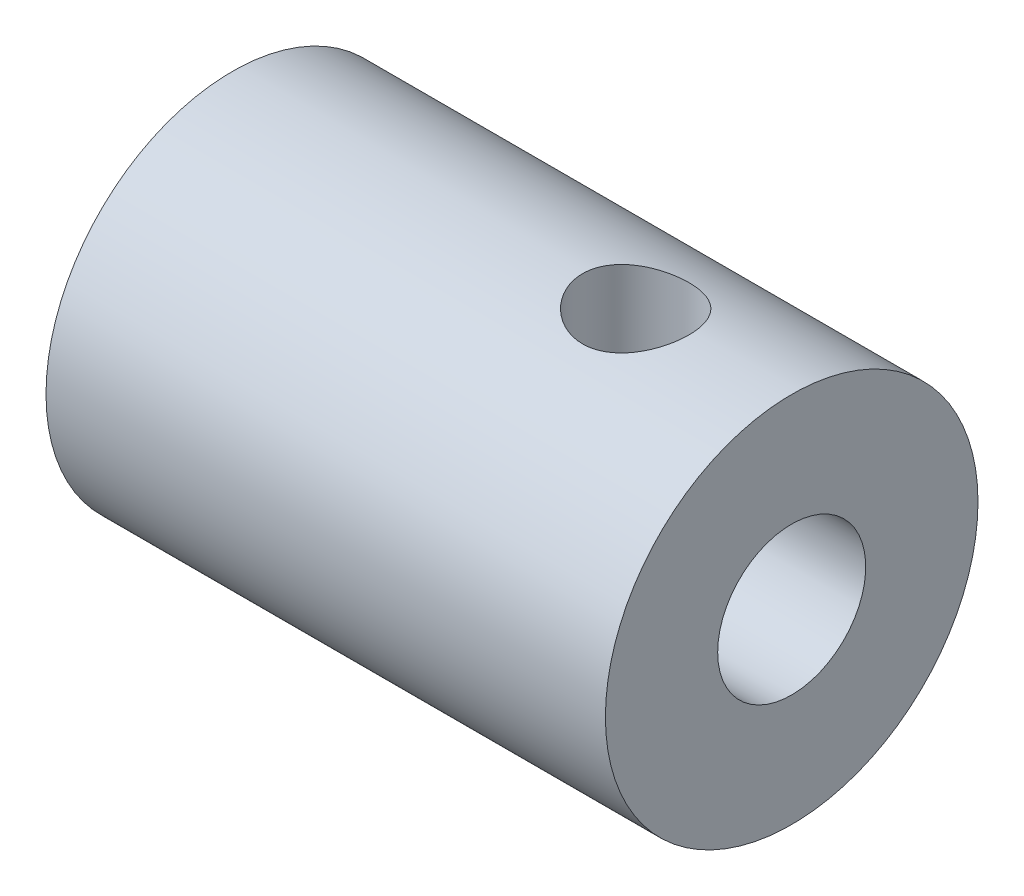
ISO-10303-21;
HEADER;
FILE_DESCRIPTION(('STEP AP214'),'2;1');
FILE_NAME('part.step','',(''),(''),'','','');
FILE_SCHEMA(('AUTOMOTIVE_DESIGN { 1 0 10303 214 1 1 1 1 }'));
ENDSEC;
DATA;
#1=APPLICATION_CONTEXT('core data for automotive mechanical design processes');
#2=APPLICATION_PROTOCOL_DEFINITION('international standard','automotive_design',2000,#1);
#3=PRODUCT_CONTEXT('',#1,'mechanical');
#4=PRODUCT('Part','Part','',(#3));
#5=PRODUCT_RELATED_PRODUCT_CATEGORY('part','',(#4));
#6=PRODUCT_DEFINITION_FORMATION('','',#4);
#7=PRODUCT_DEFINITION_CONTEXT('part definition',#1,'design');
#8=PRODUCT_DEFINITION('design','',#6,#7);
#9=PRODUCT_DEFINITION_SHAPE('','',#8);
#10=(LENGTH_UNIT() NAMED_UNIT(*) SI_UNIT(.MILLI.,.METRE.));
#11=(NAMED_UNIT(*) PLANE_ANGLE_UNIT() SI_UNIT($,.RADIAN.));
#12=(NAMED_UNIT(*) SI_UNIT($,.STERADIAN.) SOLID_ANGLE_UNIT());
#13=UNCERTAINTY_MEASURE_WITH_UNIT(LENGTH_MEASURE(1.E-05),#10,'distance_accuracy_value','');
#14=(GEOMETRIC_REPRESENTATION_CONTEXT(3) GLOBAL_UNCERTAINTY_ASSIGNED_CONTEXT((#13)) GLOBAL_UNIT_ASSIGNED_CONTEXT((#10,
#11,#12)) REPRESENTATION_CONTEXT('',''));
#15=CARTESIAN_POINT('',(0.,0.,0.));
#16=DIRECTION('',(0.,0.,1.));
#17=DIRECTION('',(1.,0.,0.));
#18=AXIS2_PLACEMENT_3D('',#15,#16,#17);
#19=CARTESIAN_POINT('',(0.,0.,0.));
#20=DIRECTION('',(-1.,0.,0.));
#21=DIRECTION('',(0.,0.,1.));
#22=AXIS2_PLACEMENT_3D('',#19,#20,#21);
#23=CYLINDRICAL_SURFACE('',#22,4.7625);
#24=CARTESIAN_POINT('',(2.6035,-4.7625,0.));
#25=CARTESIAN_POINT('',(2.60350132802397,-4.76249910615411,0.0747130529778893));
#26=CARTESIAN_POINT('',(2.60968218956907,-4.76072484176044,0.149439770560647));
#27=CARTESIAN_POINT('',(2.63419045488752,-4.75381979521838,0.29672763904972));
#28=CARTESIAN_POINT('',(2.65252248077178,-4.74868773582743,0.369287954910806));
#29=CARTESIAN_POINT('',(2.70067887838141,-4.73563130773512,0.510096647559027));
#30=CARTESIAN_POINT('',(2.73048725167652,-4.72771082749983,0.578350873706299));
#31=CARTESIAN_POINT('',(2.80068740651401,-4.70990700954045,0.708892135043703));
#32=CARTESIAN_POINT('',(2.84108028731264,-4.70002346796803,0.771178549527407));
#33=CARTESIAN_POINT('',(2.93242020746837,-4.67906373955543,0.889649651730132));
#34=CARTESIAN_POINT('',(2.98359386370883,-4.66796490800477,0.945655610055492));
#35=CARTESIAN_POINT('',(3.09455908825951,-4.64596516914378,1.0484184909622));
#36=CARTESIAN_POINT('',(3.15435194250602,-4.63506429164082,1.09517403095885));
#37=CARTESIAN_POINT('',(3.28233155601516,-4.61445881113562,1.17901776862754));
#38=CARTESIAN_POINT('',(3.35066248018866,-4.60478254947106,1.21589352500811));
#39=CARTESIAN_POINT('',(3.4928758525282,-4.5880578689383,1.27755991315349));
#40=CARTESIAN_POINT('',(3.56675710606092,-4.58100888651982,1.30235313696768));
#41=CARTESIAN_POINT('',(3.71597894243543,-4.57057187087897,1.33851692730094));
#42=CARTESIAN_POINT('',(3.7912338681259,-4.56709481286359,1.35021458589323));
#43=CARTESIAN_POINT('',(3.94271218430989,-4.56392995914291,1.36087589799455));
#44=CARTESIAN_POINT('',(4.01893536141339,-4.56424134250628,1.35984231028366));
#45=CARTESIAN_POINT('',(4.16757606825807,-4.56853893279477,1.34532862879658));
#46=CARTESIAN_POINT('',(4.24003697981751,-4.57240605959699,1.33225183347416));
#47=CARTESIAN_POINT('',(4.38169070569852,-4.58318766064072,1.29467196470204));
#48=CARTESIAN_POINT('',(4.4508832246597,-4.59010240971079,1.27016786074857));
#49=CARTESIAN_POINT('',(4.58505171619238,-4.60629950381668,1.21011778079942));
#50=CARTESIAN_POINT('',(4.64996339303076,-4.6156106498115,1.17443624887876));
#51=CARTESIAN_POINT('',(4.77301598810202,-4.63553682583539,1.09313853115981));
#52=CARTESIAN_POINT('',(4.8311553981387,-4.64615214522885,1.04752013887182));
#53=CARTESIAN_POINT('',(4.94130838962143,-4.66797933994029,0.945613808374621));
#54=CARTESIAN_POINT('',(4.99300964120024,-4.67919864201871,0.888989324200014));
#55=CARTESIAN_POINT('',(5.08625127397521,-4.70061425563701,0.767734854711598));
#56=CARTESIAN_POINT('',(5.12779113137947,-4.71081051442586,0.703104456973554));
#57=CARTESIAN_POINT('',(5.19969641337201,-4.7291097983759,0.567143378034054));
#58=CARTESIAN_POINT('',(5.22999836281593,-4.7372008583588,0.49577740978272));
#59=CARTESIAN_POINT('',(5.27808059584143,-4.75029187375806,0.348679021038379));
#60=CARTESIAN_POINT('',(5.29586402685173,-4.75529260611158,0.27294770327371));
#61=CARTESIAN_POINT('',(5.3178979067378,-4.7615190609649,0.121928159085001));
#62=CARTESIAN_POINT('',(5.32257223625847,-4.76286298156601,0.0467065564677234));
#63=CARTESIAN_POINT('',(5.31943537678374,-4.76196800761694,-0.103448322015913));
#64=CARTESIAN_POINT('',(5.31162568158639,-4.7597295417235,-0.178381631303094));
#65=CARTESIAN_POINT('',(5.28408763245719,-4.75199826556876,-0.324272411558481));
#66=CARTESIAN_POINT('',(5.26460186136451,-4.74657173442845,-0.395279512238859));
#67=CARTESIAN_POINT('',(5.21455202783244,-4.73308606280185,-0.533005492039659));
#68=CARTESIAN_POINT('',(5.18398668569606,-4.72502661822315,-0.599723874762199));
#69=CARTESIAN_POINT('',(5.11190029589263,-4.70690007925331,-0.728578003267581));
#70=CARTESIAN_POINT('',(5.0701567937936,-4.69679336748189,-0.7905835803644));
#71=CARTESIAN_POINT('',(4.97717344661831,-4.67573685565677,-0.906856321261833));
#72=CARTESIAN_POINT('',(4.92593144711736,-4.66478686466267,-0.961121724505211));
#73=CARTESIAN_POINT('',(4.81341888361094,-4.64283250450958,-1.06220467816609));
#74=CARTESIAN_POINT('',(4.75187574438686,-4.63183800989465,-1.10872158995048));
#75=CARTESIAN_POINT('',(4.62161997761782,-4.61142480451941,-1.19078217067452));
#76=CARTESIAN_POINT('',(4.55290760095905,-4.60200603864676,-1.22632622343521));
#77=CARTESIAN_POINT('',(4.41055032317316,-4.58592072488041,-1.28517268145781));
#78=CARTESIAN_POINT('',(4.33693404792279,-4.5792395959238,-1.30854012713244));
#79=CARTESIAN_POINT('',(4.18658933686106,-4.56940281032297,-1.34249121008744));
#80=CARTESIAN_POINT('',(4.10986184816905,-4.56624608900114,-1.35307870810188));
#81=CARTESIAN_POINT('',(3.95857471753248,-4.56391335454088,-1.36092455040578));
#82=CARTESIAN_POINT('',(3.88404221292628,-4.56459194886419,-1.35866970788407));
#83=CARTESIAN_POINT('',(3.73646709551818,-4.5695079526439,-1.3420420529431));
#84=CARTESIAN_POINT('',(3.66342443333104,-4.5737452439397,-1.32766964286741));
#85=CARTESIAN_POINT('',(3.52161489027463,-4.58520849858503,-1.28751515000952));
#86=CARTESIAN_POINT('',(3.45281215061304,-4.59240370727278,-1.26185029178566));
#87=CARTESIAN_POINT('',(3.32043494641326,-4.60896913868397,-1.19993011119005));
#88=CARTESIAN_POINT('',(3.25686140766293,-4.61833974542644,-1.16367291868063));
#89=CARTESIAN_POINT('',(3.1344585736249,-4.63858981495493,-1.0801812993991));
#90=CARTESIAN_POINT('',(3.07585780150345,-4.64950913599081,-1.03262149419702));
#91=CARTESIAN_POINT('',(2.96731095484128,-4.67142023258267,-0.928475317194594));
#92=CARTESIAN_POINT('',(2.91736706152056,-4.6824120256769,-0.871886677332632));
#93=CARTESIAN_POINT('',(2.82628658327082,-4.70356613921108,-0.749545117737117));
#94=CARTESIAN_POINT('',(2.78540778319881,-4.71370007221687,-0.683594906488905));
#95=CARTESIAN_POINT('',(2.71537924841101,-4.73167059506192,-0.545468955126885));
#96=CARTESIAN_POINT('',(2.68622308081922,-4.73950844425046,-0.473296655907664));
#97=CARTESIAN_POINT('',(2.64362765596444,-4.75116806432972,-0.334651372172605));
#98=CARTESIAN_POINT('',(2.62861783065919,-4.75538435031651,-0.268690220034189));
#99=CARTESIAN_POINT('',(2.6085540640398,-4.76105053847871,-0.135156295305951));
#100=CARTESIAN_POINT('',(2.60349879869955,-4.76250080855278,-0.0675837382544699));
#101=CARTESIAN_POINT('',(2.6035,-4.7625,0.));
#102=B_SPLINE_CURVE_WITH_KNOTS('',3,(#24,#25,#26,#27,#28,#29,#30,#31,#32,#33,#34,#35,#36,#37,
#38,#39,#40,#41,#42,#43,#44,#45,#46,#47,#48,#49,#50,#51,#52,#53,#54,#55,#56,#57,#58,#59,#60,#61,
#62,#63,#64,#65,#66,#67,#68,#69,#70,#71,#72,#73,#74,#75,#76,#77,#78,#79,#80,#81,#82,#83,#84,#85,
#86,#87,#88,#89,#90,#91,#92,#93,#94,#95,#96,#97,#98,#99,#100,#101),.UNSPECIFIED.,.T.,.F.,(4,2,2,
2,2,2,2,2,2,2,2,2,2,2,2,2,2,2,2,2,2,2,2,2,2,2,2,2,2,2,2,2,2,2,2,2,2,2,4),(0.,0.223891093401415,
0.447867400348589,0.671532600450734,0.895221038562009,1.1241894540172,1.3531920657071,
1.58678251369104,1.82032282774805,2.04788987982158,2.27540762043045,2.49557293839875,
2.71575811450561,2.93872435402094,3.16174015397321,3.39313717400732,3.62454611940855,
3.85724291462337,4.08988118386984,4.3149052647879,4.53990242206693,4.76037966366481,
4.98088237863229,5.20614959447117,5.43146796749921,5.66413515523558,5.89679420355434,
6.12819744276731,6.35953075914808,6.58215477179628,6.80477139287779,7.02512967857782,
7.24552689333998,7.47326441045603,7.70105922603059,7.9346772997902,8.16816699845996,
8.37072076163971,8.57324758193209),.UNSPECIFIED.);
#103=CARTESIAN_POINT('',(2.6035,-4.7625,0.));
#104=VERTEX_POINT('',#103);
#105=EDGE_CURVE('E87',#104,#104,#102,.T.);
#106=ORIENTED_EDGE('',*,*,#105,.T.);
#107=EDGE_LOOP('',(#106));
#108=FACE_BOUND('',#107,.T.);
#109=CARTESIAN_POINT('',(3.9624,4.56451498409196,1.3589));
#110=CARTESIAN_POINT('',(3.88775680747235,4.56451603505844,1.35889864477218));
#111=CARTESIAN_POINT('',(3.81309990567277,4.56636596722264,1.35272893233677));
#112=CARTESIAN_POINT('',(3.66595673304113,4.57353968308075,1.3282689601314));
#113=CARTESIAN_POINT('',(3.59347136194685,4.5788648864319,1.30997374701561));
#114=CARTESIAN_POINT('',(3.452821810095,4.59233800161285,1.26192489086453));
#115=CARTESIAN_POINT('',(3.38465113957464,4.60048154896756,1.23218895697125));
#116=CARTESIAN_POINT('',(3.25425195102654,4.61866803332666,1.16215980187808));
#117=CARTESIAN_POINT('',(3.19202413478764,4.62871119423916,1.12186533592437));
#118=CARTESIAN_POINT('',(3.07349571314445,4.64988763844925,1.03062853222179));
#119=CARTESIAN_POINT('',(3.01739041925885,4.66104242220874,0.979437394274301));
#120=CARTESIAN_POINT('',(2.91443332072471,4.68300073545277,0.8683944344393));
#121=CARTESIAN_POINT('',(2.86758259694599,4.69380422378549,0.808541602338514));
#122=CARTESIAN_POINT('',(2.78363176417749,4.71408497007954,0.680500735399147));
#123=CARTESIAN_POINT('',(2.746728546074,4.72353392466409,0.61217873366752));
#124=CARTESIAN_POINT('',(2.68500902077521,4.73979257604336,0.46998416794496));
#125=CARTESIAN_POINT('',(2.66019036689376,4.74660278520021,0.396112684819376));
#126=CARTESIAN_POINT('',(2.62398436430554,4.75666453906143,0.246957397350113));
#127=CARTESIAN_POINT('',(2.61226414341945,4.76000412033045,0.171760439109778));
#128=CARTESIAN_POINT('',(2.60153754594822,4.76305736225192,0.0203983510758831));
#129=CARTESIAN_POINT('',(2.60252874531937,4.76277171422883,-0.0557665913574317));
#130=CARTESIAN_POINT('',(2.61696842879738,4.75866994750923,-0.204575702031833));
#131=CARTESIAN_POINT('',(2.63005683283178,4.75495588164616,-0.277258060412385));
#132=CARTESIAN_POINT('',(2.66773414429947,4.74453697676865,-0.419348309010543));
#133=CARTESIAN_POINT('',(2.69232375067335,4.73783195599178,-0.4887559999408));
#134=CARTESIAN_POINT('',(2.75256364787437,4.7220387960207,-0.623211172663096));
#135=CARTESIAN_POINT('',(2.78833173211534,4.71292544484585,-0.688202796200048));
#136=CARTESIAN_POINT('',(2.86982141207442,4.69328931620833,-0.811380103200588));
#137=CARTESIAN_POINT('',(2.91554518412592,4.68276623076873,-0.869564294263584));
#138=CARTESIAN_POINT('',(3.01753618646918,4.66100863096647,-0.979624807858082));
#139=CARTESIAN_POINT('',(3.0741164574673,4.6497621074787,-1.03120903512073));
#140=CARTESIAN_POINT('',(3.19523781528815,4.6281519208778,-1.12423437267076));
#141=CARTESIAN_POINT('',(3.25977954383414,4.61778832904625,-1.16567466451448));
#142=CARTESIAN_POINT('',(3.39569862353088,4.59906394952383,-1.23750224576729));
#143=CARTESIAN_POINT('',(3.46712620240598,4.59071972559669,-1.2677991178051));
#144=CARTESIAN_POINT('',(3.61436077898793,4.57717888973541,-1.3158533346299));
#145=CARTESIAN_POINT('',(3.690166499486,4.57198136486361,-1.33361431664655));
#146=CARTESIAN_POINT('',(3.841247102289,4.56552016513002,-1.35556601937419));
#147=CARTESIAN_POINT('',(3.91645261995628,4.56412891686529,-1.36019701320162));
#148=CARTESIAN_POINT('',(4.06656580839842,4.56508668911583,-1.35697936218475));
#149=CARTESIAN_POINT('',(4.14147351504998,4.56743524451886,-1.34913226921643));
#150=CARTESIAN_POINT('',(4.2870928478525,4.57548366916004,-1.32157158878809));
#151=CARTESIAN_POINT('',(4.35786121944589,4.58110584172206,-1.30213286938459));
#152=CARTESIAN_POINT('',(4.49513020897776,4.59498959657531,-1.25225502456966));
#153=CARTESIAN_POINT('',(4.56163021063817,4.60325155898123,-1.22181431485138));
#154=CARTESIAN_POINT('',(4.69028873180816,4.62173788057312,-1.1499351246311));
#155=CARTESIAN_POINT('',(4.7522995442902,4.63200565032771,-1.10824369348473));
#156=CARTESIAN_POINT('',(4.8686062233809,4.65324948525838,-1.01535279969331));
#157=CARTESIAN_POINT('',(4.92290041801461,4.66422570318845,-0.964151282005915));
#158=CARTESIAN_POINT('',(5.02411361537,4.68609700628366,-0.851638739480496));
#159=CARTESIAN_POINT('',(5.0707227488091,4.6969769166886,-0.790045376166007));
#160=CARTESIAN_POINT('',(5.15294595997986,4.71705439310083,-0.65965786929976));
#161=CARTESIAN_POINT('',(5.18856061289626,4.7262520471064,-0.590864102694882));
#162=CARTESIAN_POINT('',(5.24744410028156,4.7418701151326,-0.44850498948744));
#163=CARTESIAN_POINT('',(5.27080637043856,4.74831147680547,-0.374980702439351));
#164=CARTESIAN_POINT('',(5.30477794345696,4.75778370690101,-0.224835405201785));
#165=CARTESIAN_POINT('',(5.31539051747125,4.76081545010694,-0.148215194541387));
#166=CARTESIAN_POINT('',(5.32333224993471,4.76307896423585,0.00306974476281752));
#167=CARTESIAN_POINT('',(5.32111299188128,4.76243992427809,0.0777091466746419));
#168=CARTESIAN_POINT('',(5.3045195284057,4.75773257745494,0.225507834068754));
#169=CARTESIAN_POINT('',(5.29014590235253,4.75366443404656,0.298667189931017));
#170=CARTESIAN_POINT('',(5.24992097554746,4.74258792732383,0.44080315972444));
#171=CARTESIAN_POINT('',(5.22417290505636,4.73560603890715,0.509811190477982));
#172=CARTESIAN_POINT('',(5.16202181096896,4.71942712391017,0.642565871342411));
#173=CARTESIAN_POINT('',(5.12561714069588,4.71022975502881,0.706311706376398));
#174=CARTESIAN_POINT('',(5.04193028981196,4.69025443463538,0.828786176541995));
#175=CARTESIAN_POINT('',(4.99435736617556,4.67943767727524,0.887309780155601));
#176=CARTESIAN_POINT('',(4.89022048918341,4.65758097992779,0.995695158400413));
#177=CARTESIAN_POINT('',(4.8336540543266,4.6465409790788,1.04555453441665));
#178=CARTESIAN_POINT('',(4.71135654230063,4.6251507988277,1.13649915276305));
#179=CARTESIAN_POINT('',(4.64542432333091,4.6148262419371,1.17732054867892));
#180=CARTESIAN_POINT('',(4.50734679096369,4.59642238253575,1.24724617335738));
#181=CARTESIAN_POINT('',(4.4352049951183,4.58834181968777,1.27635698349835));
#182=CARTESIAN_POINT('',(4.29666571352837,4.57628886550273,1.31886549351769));
#183=CARTESIAN_POINT('',(4.23078347964178,4.57191256961725,1.33383994666801));
#184=CARTESIAN_POINT('',(4.09740439843775,4.56602537831392,1.35385703407256));
#185=CARTESIAN_POINT('',(4.02990780597892,4.56451403359079,1.35890122567717));
#186=CARTESIAN_POINT('',(3.9624,4.56451498409196,1.3589));
#187=B_SPLINE_CURVE_WITH_KNOTS('',3,(#109,#110,#111,#112,#113,#114,#115,#116,#117,#118,#119,
#120,#121,#122,#123,#124,#125,#126,#127,#128,#129,#130,#131,#132,#133,#134,#135,#136,#137,#138,
#139,#140,#141,#142,#143,#144,#145,#146,#147,#148,#149,#150,#151,#152,#153,#154,#155,#156,#157,
#158,#159,#160,#161,#162,#163,#164,#165,#166,#167,#168,#169,#170,#171,#172,#173,#174,#175,#176,
#177,#178,#179,#180,#181,#182,#183,#184,#185,#186),.UNSPECIFIED.,.T.,.F.,(4,2,2,2,2,2,2,2,2,2,2,
2,2,2,2,2,2,2,2,2,2,2,2,2,2,2,2,2,2,2,2,2,2,2,2,2,2,2,4),(0.,0.223680920434435,
0.447453272345167,0.670880630615005,0.894334340775211,1.12357681371209,1.3528460447753,
1.58636613521695,1.8198408605862,2.04723686453817,2.27458950514853,2.495385521695,
2.71619495799944,2.93941443657241,3.16268276045118,3.39376642707039,3.62486873208408,
3.85780685740799,4.09067736901402,4.3156412845543,4.54057722394729,4.76038034122677,
4.98021512317868,5.20547698273278,5.4307875760569,5.66368427352624,5.89656878475934,
6.12765052026222,6.35867295511819,6.58161578787048,6.80454799408254,7.02549723564213,
7.24648063671068,7.47402200068518,7.70162625746982,7.93518852109772,8.16861933815232,
8.37094960261782,8.57324813335495),.UNSPECIFIED.);
#188=CARTESIAN_POINT('',(3.9624,4.56451498409196,1.3589));
#189=VERTEX_POINT('',#188);
#190=EDGE_CURVE('E81',#189,#189,#187,.T.);
#191=ORIENTED_EDGE('',*,*,#190,.T.);
#192=EDGE_LOOP('',(#191));
#193=FACE_BOUND('',#192,.T.);
#194=CARTESIAN_POINT('',(-6.35,0.,0.));
#195=DIRECTION('',(-1.,0.,0.));
#196=DIRECTION('',(0.,0.,1.));
#197=AXIS2_PLACEMENT_3D('',#194,#195,#196);
#198=CIRCLE('',#197,4.7625);
#199=CARTESIAN_POINT('',(-6.35,0.,4.7625));
#200=VERTEX_POINT('',#199);
#201=EDGE_CURVE('E10',#200,#200,#198,.T.);
#202=ORIENTED_EDGE('',*,*,#201,.F.);
#203=EDGE_LOOP('',(#202));
#204=FACE_BOUND('',#203,.T.);
#205=CARTESIAN_POINT('',(7.9502,0.,0.));
#206=DIRECTION('',(-1.,0.,0.));
#207=DIRECTION('',(0.,0.,1.));
#208=AXIS2_PLACEMENT_3D('',#205,#206,#207);
#209=CIRCLE('',#208,4.7625);
#210=CARTESIAN_POINT('',(7.9502,0.,4.7625));
#211=VERTEX_POINT('',#210);
#212=EDGE_CURVE('E94',#211,#211,#209,.T.);
#213=ORIENTED_EDGE('',*,*,#212,.T.);
#214=EDGE_LOOP('',(#213));
#215=FACE_BOUND('',#214,.T.);
#216=ADVANCED_FACE('F37',(#108,#193,#204,#215),#23,.T.);
#217=CARTESIAN_POINT('',(-6.35,4.7625,0.));
#218=DIRECTION('',(1.,0.,0.));
#219=DIRECTION('',(0.,0.,-1.));
#220=AXIS2_PLACEMENT_3D('',#217,#218,#219);
#221=PLANE('',#220);
#222=CARTESIAN_POINT('',(-6.35,0.,0.));
#223=DIRECTION('',(-1.,0.,0.));
#224=DIRECTION('',(0.,0.,1.));
#225=AXIS2_PLACEMENT_3D('',#222,#223,#224);
#226=CIRCLE('',#225,3.175);
#227=CARTESIAN_POINT('',(-6.35,0.,3.175));
#228=VERTEX_POINT('',#227);
#229=EDGE_CURVE('E51',#228,#228,#226,.T.);
#230=ORIENTED_EDGE('',*,*,#229,.F.);
#231=EDGE_LOOP('',(#230));
#232=FACE_BOUND('',#231,.T.);
#233=ORIENTED_EDGE('',*,*,#201,.T.);
#234=EDGE_LOOP('',(#233));
#235=FACE_BOUND('',#234,.T.);
#236=ADVANCED_FACE('F114',(#232,#235),#221,.F.);
#237=CARTESIAN_POINT('',(0.,0.,0.));
#238=DIRECTION('',(-1.,0.,0.));
#239=DIRECTION('',(0.,0.,1.));
#240=AXIS2_PLACEMENT_3D('',#237,#238,#239);
#241=CYLINDRICAL_SURFACE('',#240,3.175);
#242=CARTESIAN_POINT('',(0.,0.,0.));
#243=DIRECTION('',(-1.,0.,0.));
#244=DIRECTION('',(0.,0.,1.));
#245=AXIS2_PLACEMENT_3D('',#242,#243,#244);
#246=CIRCLE('',#245,3.175);
#247=CARTESIAN_POINT('',(0.,0.,3.175));
#248=VERTEX_POINT('',#247);
#249=EDGE_CURVE('E57',#248,#248,#246,.T.);
#250=ORIENTED_EDGE('',*,*,#249,.F.);
#251=EDGE_LOOP('',(#250));
#252=FACE_BOUND('',#251,.T.);
#253=ORIENTED_EDGE('',*,*,#229,.T.);
#254=EDGE_LOOP('',(#253));
#255=FACE_BOUND('',#254,.T.);
#256=ADVANCED_FACE('F111',(#252,#255),#241,.F.);
#257=CARTESIAN_POINT('',(0.,3.175,0.));
#258=DIRECTION('',(1.,0.,0.));
#259=DIRECTION('',(0.,0.,-1.));
#260=AXIS2_PLACEMENT_3D('',#257,#258,#259);
#261=PLANE('',#260);
#262=CARTESIAN_POINT('',(0.,0.,0.));
#263=DIRECTION('',(-1.,0.,0.));
#264=DIRECTION('',(0.,0.,1.));
#265=AXIS2_PLACEMENT_3D('',#262,#263,#264);
#266=CIRCLE('',#265,1.8923);
#267=CARTESIAN_POINT('',(0.,0.,1.8923));
#268=VERTEX_POINT('',#267);
#269=EDGE_CURVE('E102',#268,#268,#266,.T.);
#270=ORIENTED_EDGE('',*,*,#269,.F.);
#271=EDGE_LOOP('',(#270));
#272=FACE_BOUND('',#271,.T.);
#273=ORIENTED_EDGE('',*,*,#249,.T.);
#274=EDGE_LOOP('',(#273));
#275=FACE_BOUND('',#274,.T.);
#276=ADVANCED_FACE('F109',(#272,#275),#261,.F.);
#277=CARTESIAN_POINT('',(0.,0.,0.));
#278=DIRECTION('',(-1.,0.,0.));
#279=DIRECTION('',(0.,0.,1.));
#280=AXIS2_PLACEMENT_3D('',#277,#278,#279);
#281=CYLINDRICAL_SURFACE('',#280,1.8923);
#282=CARTESIAN_POINT('',(3.9624,-1.31688650991648,1.3589));
#283=CARTESIAN_POINT('',(3.89788385925469,-1.31690069966418,1.35889262101807));
#284=CARTESIAN_POINT('',(3.83326236441676,-1.32173627858595,1.35425084220462));
#285=CARTESIAN_POINT('',(3.70646651858613,-1.34003752094971,1.33613152575644));
#286=CARTESIAN_POINT('',(3.64430095120761,-1.3535316239108,1.32262486745642));
#287=CARTESIAN_POINT('',(3.52478811570053,-1.38651565461787,1.2879954250738));
#288=CARTESIAN_POINT('',(3.46739106907756,-1.40592994902377,1.26696816576576));
#289=CARTESIAN_POINT('',(3.35710356897393,-1.44844077155282,1.21814047362099));
#290=CARTESIAN_POINT('',(3.30421261536512,-1.47153689021373,1.19034079377584));
#291=CARTESIAN_POINT('',(3.19361691114724,-1.523948807903,1.12273401073574));
#292=CARTESIAN_POINT('',(3.13685879136949,-1.55362048005007,1.0816539415278));
#293=CARTESIAN_POINT('',(3.03018786779875,-1.61283765811837,0.991203998407445));
#294=CARTESIAN_POINT('',(2.98028430463641,-1.64238294269739,0.9418231296762));
#295=CARTESIAN_POINT('',(2.87980787890324,-1.70421770128572,0.825541652291071));
#296=CARTESIAN_POINT('',(2.83072206045524,-1.7360481299545,0.757087305635841));
#297=CARTESIAN_POINT('',(2.74524779902996,-1.7929408655652,0.610185153728587));
#298=CARTESIAN_POINT('',(2.70883246115168,-1.81801748253417,0.531759004570625));
#299=CARTESIAN_POINT('',(2.65924687707992,-1.85261504635145,0.390308940271687));
#300=CARTESIAN_POINT('',(2.64242097861031,-1.86452662608329,0.329141113701179));
#301=CARTESIAN_POINT('',(2.61742759826753,-1.88230222125721,0.204216898308314));
#302=CARTESIAN_POINT('',(2.60925295655742,-1.88817123745517,0.140462695437964));
#303=CARTESIAN_POINT('',(2.60202847265667,-1.89335535299015,0.0120293604582454));
#304=CARTESIAN_POINT('',(2.60299843435754,-1.8926562281293,-0.0526514760281261));
#305=CARTESIAN_POINT('',(2.61404888010639,-1.88473505771324,-0.180827077669343));
#306=CARTESIAN_POINT('',(2.62413178918065,-1.8775112758963,-0.244321522525443));
#307=CARTESIAN_POINT('',(2.65243561489102,-1.85744469133319,-0.36666426217748));
#308=CARTESIAN_POINT('',(2.67043080406481,-1.84475793453233,-0.425591524825731));
#309=CARTESIAN_POINT('',(2.71366896095537,-1.81473902600466,-0.539436535700137));
#310=CARTESIAN_POINT('',(2.73891336899996,-1.79740595115897,-0.594353484405319));
#311=CARTESIAN_POINT('',(2.79894719758593,-1.75706085323754,-0.705262438958607));
#312=CARTESIAN_POINT('',(2.83448607327538,-1.73363156571951,-0.760694329234779));
#313=CARTESIAN_POINT('',(2.91243182832854,-1.68395980164087,-0.865118211747659));
#314=CARTESIAN_POINT('',(2.95484564983241,-1.65771449068527,-0.914103602927839));
#315=CARTESIAN_POINT('',(3.05425437843629,-1.59906558588868,-1.01376454510545));
#316=CARTESIAN_POINT('',(3.11249411838475,-1.56642423381671,-1.06306114533013));
#317=CARTESIAN_POINT('',(3.23692908811404,-1.50254503312209,-1.15157760591072));
#318=CARTESIAN_POINT('',(3.30312437924781,-1.47130719532586,-1.19079738854724));
#319=CARTESIAN_POINT('',(3.42745795243157,-1.42052761868778,-1.25063307283063));
#320=CARTESIAN_POINT('',(3.48410130109811,-1.39993105754806,-1.27344727008142));
#321=CARTESIAN_POINT('',(3.60149474713064,-1.36430907330471,-1.3115427955135));
#322=CARTESIAN_POINT('',(3.66223537504835,-1.34927129164108,-1.32684085919094));
#323=CARTESIAN_POINT('',(3.77729947207902,-1.32881671785649,-1.3473031183499));
#324=CARTESIAN_POINT('',(3.83120983555639,-1.32229124913873,-1.35364739648153));
#325=CARTESIAN_POINT('',(3.93978468578356,-1.315968865655,-1.35979704225191));
#326=CARTESIAN_POINT('',(3.99444862532356,-1.31616730157818,-1.35960692815994));
#327=CARTESIAN_POINT('',(4.10279946188836,-1.32324526158095,-1.35271652136653));
#328=CARTESIAN_POINT('',(4.15648796624497,-1.33011253789109,-1.3460281631123));
#329=CARTESIAN_POINT('',(4.26173065781698,-1.34948112937432,-1.32660629123912));
#330=CARTESIAN_POINT('',(4.313281540332,-1.3619908371672,-1.31386377107543));
#331=CARTESIAN_POINT('',(4.43412263439179,-1.39718317736958,-1.27654703339379));
#332=CARTESIAN_POINT('',(4.50196535427474,-1.4219335754391,-1.24926081995277));
#333=CARTESIAN_POINT('',(4.63112710843277,-1.47577775060295,-1.18517263299474));
#334=CARTESIAN_POINT('',(4.69243292530336,-1.50488005214057,-1.1483518774143));
#335=CARTESIAN_POINT('',(4.80976484168963,-1.56512688886214,-1.06484866217475));
#336=CARTESIAN_POINT('',(4.86560096500205,-1.59630549520499,-1.01792428428116));
#337=CARTESIAN_POINT('',(4.96940705412099,-1.65725486226636,-0.915348116376853));
#338=CARTESIAN_POINT('',(5.01738428808477,-1.68702690547552,-0.859704484492946));
#339=CARTESIAN_POINT('',(5.10145420070135,-1.74088197130779,-0.744246428826472));
#340=CARTESIAN_POINT('',(5.13813759729922,-1.76521552194753,-0.684982694968015));
#341=CARTESIAN_POINT('',(5.20254080070028,-1.80874988838191,-0.559994578572679));
#342=CARTESIAN_POINT('',(5.2302638514747,-1.82795256130365,-0.494272545437692));
#343=CARTESIAN_POINT('',(5.27550849294399,-1.85961825623246,-0.357207815822083));
#344=CARTESIAN_POINT('',(5.29294900939711,-1.87202766235068,-0.285825356154724));
#345=CARTESIAN_POINT('',(5.31604426351669,-1.88851137516318,-0.140253676295416));
#346=CARTESIAN_POINT('',(5.32171014587006,-1.8925935634986,-0.0660671779206628));
#347=CARTESIAN_POINT('',(5.32090044451818,-1.89201391178482,0.0722146332667945));
#348=CARTESIAN_POINT('',(5.31594947357762,-1.88845003456879,0.136330631463385));
#349=CARTESIAN_POINT('',(5.29721597220783,-1.87506814529856,0.262577966978671));
#350=CARTESIAN_POINT('',(5.28343275905883,-1.86524964977161,0.324709150484201));
#351=CARTESIAN_POINT('',(5.24795417274273,-1.84029426729144,0.444798289071421));
#352=CARTESIAN_POINT('',(5.22633950281433,-1.82521168304301,0.502791836049407));
#353=CARTESIAN_POINT('',(5.17608812034409,-1.79078042964538,0.614257044903136));
#354=CARTESIAN_POINT('',(5.14745024822781,-1.77143105607593,0.667727958101207));
#355=CARTESIAN_POINT('',(5.07966119238481,-1.7267665816177,0.776525186863846));
#356=CARTESIAN_POINT('',(5.0396066848981,-1.70099721934298,0.831099670237109));
#357=CARTESIAN_POINT('',(4.95250107935629,-1.64721449908094,0.933177935112149));
#358=CARTESIAN_POINT('',(4.9054396325443,-1.61919785072897,0.980671046684199));
#359=CARTESIAN_POINT('',(4.79575141152804,-1.55763409308824,1.07627451724541));
#360=CARTESIAN_POINT('',(4.73185402673986,-1.52401817561264,1.1228895884214));
#361=CARTESIAN_POINT('',(4.59572173272727,-1.46002943417703,1.20491131261281));
#362=CARTESIAN_POINT('',(4.52349508766394,-1.42965345224952,1.24032894717001));
#363=CARTESIAN_POINT('',(4.39423772146461,-1.38498807073977,1.2897151493265));
#364=CARTESIAN_POINT('',(4.33917515580967,-1.36860857381942,1.30693100527423));
#365=CARTESIAN_POINT('',(4.22600251436061,-1.34189758946131,1.33434774593818));
#366=CARTESIAN_POINT('',(4.16790382472558,-1.33154505626538,1.34457306322888));
#367=CARTESIAN_POINT('',(4.08477360814523,-1.32233826274259,1.35359978379636));
#368=CARTESIAN_POINT('',(4.06039302869789,-1.32030248204365,1.3555829838681));
#369=CARTESIAN_POINT('',(4.0114800780873,-1.31757371245968,1.3582346853791));
#370=CARTESIAN_POINT('',(3.98694766518826,-1.31688111087724,1.35890280761955));
#371=CARTESIAN_POINT('',(3.9624,-1.31688650991648,1.3589));
#372=B_SPLINE_CURVE_WITH_KNOTS('',3,(#282,#283,#284,#285,#286,#287,#288,#289,#290,#291,#292,
#293,#294,#295,#296,#297,#298,#299,#300,#301,#302,#303,#304,#305,#306,#307,#308,#309,#310,#311,
#312,#313,#314,#315,#316,#317,#318,#319,#320,#321,#322,#323,#324,#325,#326,#327,#328,#329,#330,
#331,#332,#333,#334,#335,#336,#337,#338,#339,#340,#341,#342,#343,#344,#345,#346,#347,#348,#349,
#350,#351,#352,#353,#354,#355,#356,#357,#358,#359,#360,#361,#362,#363,#364,#365,#366,#367,#368,
#369,#370,#371),.UNSPECIFIED.,.T.,.F.,(4,2,2,2,2,2,2,2,2,2,2,2,2,2,2,2,2,2,2,2,2,2,2,2,2,2,2,2,
2,2,2,2,2,2,2,2,2,2,2,2,2,2,2,2,4),(0.,0.193423966225681,0.38748652172988,0.579166917699721,
0.770826011403808,0.998290338177126,1.22605836162336,1.49470120984023,1.76277029585946,
1.95559141473535,2.14825282849366,2.34133157261743,2.53446171163175,2.72240735305316,
2.91039036275707,3.11928703272381,3.32839597040637,3.57638173546198,3.82436941309828,
4.01705790916179,4.20931539647829,4.37258800891242,4.53574772717758,4.69860835736456,
4.86171203133842,5.09205160096399,5.32284841406427,5.5599499740569,5.79683100139179,
6.01740753208623,6.23790411636704,6.46011676235035,6.68211898817423,6.87438560274961,
7.06666708105426,7.25702097010864,7.44740630896006,7.66391051805905,7.8807377201977,
8.13747314426588,8.39395599625097,8.57325272528424,8.75191954734441,8.82549397693504,
8.89908961838912),.UNSPECIFIED.);
#373=CARTESIAN_POINT('',(3.9624,-1.31688650991648,1.3589));
#374=VERTEX_POINT('',#373);
#375=EDGE_CURVE('E41',#374,#374,#372,.T.);
#376=ORIENTED_EDGE('',*,*,#375,.T.);
#377=EDGE_LOOP('',(#376));
#378=FACE_BOUND('',#377,.T.);
#379=CARTESIAN_POINT('',(3.9624,1.31688650991648,1.3589));
#380=CARTESIAN_POINT('',(4.02691614074532,1.31690069966418,1.35889262101807));
#381=CARTESIAN_POINT('',(4.09153763558324,1.32173627858595,1.35425084220462));
#382=CARTESIAN_POINT('',(4.21833348141387,1.34003752094971,1.33613152575644));
#383=CARTESIAN_POINT('',(4.28049904879239,1.3535316239108,1.32262486745642));
#384=CARTESIAN_POINT('',(4.40001188429948,1.38651565461787,1.2879954250738));
#385=CARTESIAN_POINT('',(4.45740893092244,1.40592994902377,1.26696816576576));
#386=CARTESIAN_POINT('',(4.56769643102607,1.44844077155282,1.21814047362099));
#387=CARTESIAN_POINT('',(4.62058738463488,1.47153689021373,1.19034079377584));
#388=CARTESIAN_POINT('',(4.73118308885276,1.523948807903,1.12273401073574));
#389=CARTESIAN_POINT('',(4.78794120863051,1.55362048005007,1.0816539415278));
#390=CARTESIAN_POINT('',(4.89461213220125,1.61283765811837,0.991203998407446));
#391=CARTESIAN_POINT('',(4.9445156953636,1.64238294269739,0.941823129676201));
#392=CARTESIAN_POINT('',(5.04499212109676,1.70421770128572,0.825541652291073));
#393=CARTESIAN_POINT('',(5.09407793954476,1.7360481299545,0.757087305635842));
#394=CARTESIAN_POINT('',(5.17955220097004,1.7929408655652,0.610185153728588));
#395=CARTESIAN_POINT('',(5.21596753884832,1.81801748253417,0.531759004570627));
#396=CARTESIAN_POINT('',(5.26555312292008,1.85261504635145,0.390308940271689));
#397=CARTESIAN_POINT('',(5.28237902138969,1.86452662608329,0.329141113701181));
#398=CARTESIAN_POINT('',(5.30737240173248,1.88230222125721,0.204216898308316));
#399=CARTESIAN_POINT('',(5.31554704344258,1.88817123745517,0.140462695437966));
#400=CARTESIAN_POINT('',(5.32277152734333,1.89335535299015,0.0120293604582475));
#401=CARTESIAN_POINT('',(5.32180156564246,1.8926562281293,-0.052651476028124));
#402=CARTESIAN_POINT('',(5.31075111989361,1.88473505771324,-0.180827077669341));
#403=CARTESIAN_POINT('',(5.30066821081936,1.8775112758963,-0.244321522525441));
#404=CARTESIAN_POINT('',(5.27236438510898,1.85744469133319,-0.366664262177479));
#405=CARTESIAN_POINT('',(5.2543691959352,1.84475793453233,-0.425591524825729));
#406=CARTESIAN_POINT('',(5.21113103904464,1.81473902600466,-0.539436535700136));
#407=CARTESIAN_POINT('',(5.18588663100004,1.79740595115897,-0.594353484405318));
#408=CARTESIAN_POINT('',(5.12585280241408,1.75706085323754,-0.705262438958606));
#409=CARTESIAN_POINT('',(5.09031392672463,1.73363156571951,-0.760694329234778));
#410=CARTESIAN_POINT('',(5.01236817167146,1.68395980164087,-0.865118211747657));
#411=CARTESIAN_POINT('',(4.96995435016759,1.65771449068527,-0.914103602927838));
#412=CARTESIAN_POINT('',(4.87054562156372,1.59906558588868,-1.01376454510545));
#413=CARTESIAN_POINT('',(4.81230588161525,1.56642423381671,-1.06306114533013));
#414=CARTESIAN_POINT('',(4.68787091188597,1.50254503312209,-1.15157760591072));
#415=CARTESIAN_POINT('',(4.6216756207522,1.47130719532586,-1.19079738854724));
#416=CARTESIAN_POINT('',(4.49734204756843,1.42052761868778,-1.25063307283063));
#417=CARTESIAN_POINT('',(4.44069869890189,1.39993105754806,-1.27344727008142));
#418=CARTESIAN_POINT('',(4.32330525286936,1.36430907330471,-1.3115427955135));
#419=CARTESIAN_POINT('',(4.26256462495165,1.34927129164108,-1.32684085919094));
#420=CARTESIAN_POINT('',(4.14750052792099,1.32881671785649,-1.3473031183499));
#421=CARTESIAN_POINT('',(4.09359016444362,1.32229124913873,-1.35364739648153));
#422=CARTESIAN_POINT('',(3.98501531421644,1.315968865655,-1.35979704225191));
#423=CARTESIAN_POINT('',(3.93035137467645,1.31616730157818,-1.35960692815994));
#424=CARTESIAN_POINT('',(3.82200053811165,1.32324526158095,-1.35271652136654));
#425=CARTESIAN_POINT('',(3.76831203375503,1.33011253789109,-1.3460281631123));
#426=CARTESIAN_POINT('',(3.66306934218303,1.34948112937432,-1.32660629123912));
#427=CARTESIAN_POINT('',(3.611518459668,1.3619908371672,-1.31386377107543));
#428=CARTESIAN_POINT('',(3.49067736560822,1.39718317736958,-1.27654703339379));
#429=CARTESIAN_POINT('',(3.42283464572527,1.4219335754391,-1.24926081995277));
#430=CARTESIAN_POINT('',(3.29367289156723,1.47577775060295,-1.18517263299474));
#431=CARTESIAN_POINT('',(3.23236707469664,1.50488005214056,-1.1483518774143));
#432=CARTESIAN_POINT('',(3.11503515831038,1.56512688886214,-1.06484866217475));
#433=CARTESIAN_POINT('',(3.05919903499795,1.59630549520499,-1.01792428428116));
#434=CARTESIAN_POINT('',(2.95539294587901,1.65725486226636,-0.915348116376856));
#435=CARTESIAN_POINT('',(2.90741571191524,1.68702690547552,-0.859704484492949));
#436=CARTESIAN_POINT('',(2.82334579929866,1.74088197130779,-0.744246428826476));
#437=CARTESIAN_POINT('',(2.78666240270079,1.76521552194753,-0.68498269496802));
#438=CARTESIAN_POINT('',(2.72225919929972,1.80874988838191,-0.559994578572684));
#439=CARTESIAN_POINT('',(2.69453614852531,1.82795256130365,-0.494272545437696));
#440=CARTESIAN_POINT('',(2.64929150705602,1.85961825623246,-0.357207815822087));
#441=CARTESIAN_POINT('',(2.6318509906029,1.87202766235068,-0.285825356154728));
#442=CARTESIAN_POINT('',(2.60875573648331,1.88851137516318,-0.140253676295421));
#443=CARTESIAN_POINT('',(2.60308985412994,1.8925935634986,-0.0660671779206666));
#444=CARTESIAN_POINT('',(2.60389955548182,1.89201391178483,0.0722146332667916));
#445=CARTESIAN_POINT('',(2.60885052642238,1.88845003456879,0.136330631463383));
#446=CARTESIAN_POINT('',(2.62758402779217,1.87506814529856,0.262577966978669));
#447=CARTESIAN_POINT('',(2.64136724094117,1.86524964977161,0.324709150484199));
#448=CARTESIAN_POINT('',(2.67684582725727,1.84029426729144,0.444798289071418));
#449=CARTESIAN_POINT('',(2.69846049718567,1.82521168304301,0.502791836049404));
#450=CARTESIAN_POINT('',(2.74871187965591,1.79078042964538,0.614257044903134));
#451=CARTESIAN_POINT('',(2.77734975177219,1.77143105607593,0.667727958101205));
#452=CARTESIAN_POINT('',(2.84513880761519,1.72676658161771,0.776525186863844));
#453=CARTESIAN_POINT('',(2.88519331510191,1.70099721934298,0.831099670237108));
#454=CARTESIAN_POINT('',(2.97229892064371,1.64721449908094,0.933177935112147));
#455=CARTESIAN_POINT('',(3.0193603674557,1.61919785072897,0.980671046684197));
#456=CARTESIAN_POINT('',(3.12904858847196,1.55763409308824,1.07627451724541));
#457=CARTESIAN_POINT('',(3.19294597326014,1.52401817561264,1.1228895884214));
#458=CARTESIAN_POINT('',(3.32907826727273,1.46002943417704,1.20491131261281));
#459=CARTESIAN_POINT('',(3.40130491233606,1.42965345224952,1.24032894717001));
#460=CARTESIAN_POINT('',(3.53056227853539,1.38498807073977,1.2897151493265));
#461=CARTESIAN_POINT('',(3.58562484419033,1.36860857381942,1.30693100527423));
#462=CARTESIAN_POINT('',(3.69879748563939,1.34189758946131,1.33434774593818));
#463=CARTESIAN_POINT('',(3.75689617527442,1.33154505626538,1.34457306322888));
#464=CARTESIAN_POINT('',(3.84002639185478,1.32233826274259,1.35359978379636));
#465=CARTESIAN_POINT('',(3.86440697130211,1.32030248204365,1.3555829838681));
#466=CARTESIAN_POINT('',(3.9133199219127,1.31757371245968,1.3582346853791));
#467=CARTESIAN_POINT('',(3.93785233481174,1.31688111087723,1.35890280761955));
#468=CARTESIAN_POINT('',(3.9624,1.31688650991648,1.3589));
#469=B_SPLINE_CURVE_WITH_KNOTS('',3,(#379,#380,#381,#382,#383,#384,#385,#386,#387,#388,#389,
#390,#391,#392,#393,#394,#395,#396,#397,#398,#399,#400,#401,#402,#403,#404,#405,#406,#407,#408,
#409,#410,#411,#412,#413,#414,#415,#416,#417,#418,#419,#420,#421,#422,#423,#424,#425,#426,#427,
#428,#429,#430,#431,#432,#433,#434,#435,#436,#437,#438,#439,#440,#441,#442,#443,#444,#445,#446,
#447,#448,#449,#450,#451,#452,#453,#454,#455,#456,#457,#458,#459,#460,#461,#462,#463,#464,#465,
#466,#467,#468),.UNSPECIFIED.,.T.,.F.,(4,2,2,2,2,2,2,2,2,2,2,2,2,2,2,2,2,2,2,2,2,2,2,2,2,2,2,2,
2,2,2,2,2,2,2,2,2,2,2,2,2,2,2,2,4),(0.,0.193423966225681,0.38748652172988,0.57916691769972,
0.770826011403806,0.998290338177125,1.22605836162336,1.49470120984023,1.76277029585946,
1.95559141473535,2.14825282849366,2.34133157261742,2.53446171163175,2.72240735305315,
2.91039036275707,3.11928703272381,3.32839597040637,3.57638173546198,3.82436941309828,
4.01705790916179,4.20931539647829,4.37258800891242,4.53574772717758,4.69860835736456,
4.86171203133841,5.09205160096399,5.32284841406427,5.55994997405689,5.79683100139178,
6.01740753208622,6.23790411636703,6.46011676235034,6.68211898817423,6.87438560274961,
7.06666708105425,7.25702097010863,7.44740630896005,7.66391051805904,7.8807377201977,
8.13747314426588,8.39395599625096,8.57325272528423,8.75191954734441,8.82549397693503,
8.89908961838912),.UNSPECIFIED.);
#470=CARTESIAN_POINT('',(3.9624,1.31688650991648,1.3589));
#471=VERTEX_POINT('',#470);
#472=EDGE_CURVE('E60',#471,#471,#469,.T.);
#473=ORIENTED_EDGE('',*,*,#472,.T.);
#474=EDGE_LOOP('',(#473));
#475=FACE_BOUND('',#474,.T.);
#476=CARTESIAN_POINT('',(7.9502,0.,0.));
#477=DIRECTION('',(-1.,0.,0.));
#478=DIRECTION('',(0.,0.,1.));
#479=AXIS2_PLACEMENT_3D('',#476,#477,#478);
#480=CIRCLE('',#479,1.8923);
#481=CARTESIAN_POINT('',(7.9502,0.,1.8923));
#482=VERTEX_POINT('',#481);
#483=EDGE_CURVE('E98',#482,#482,#480,.T.);
#484=ORIENTED_EDGE('',*,*,#483,.F.);
#485=EDGE_LOOP('',(#484));
#486=FACE_BOUND('',#485,.T.);
#487=ORIENTED_EDGE('',*,*,#269,.T.);
#488=EDGE_LOOP('',(#487));
#489=FACE_BOUND('',#488,.T.);
#490=ADVANCED_FACE('F66',(#378,#475,#486,#489),#281,.F.);
#491=CARTESIAN_POINT('',(7.9502,1.8923,0.));
#492=DIRECTION('',(-1.,0.,0.));
#493=DIRECTION('',(0.,0.,1.));
#494=AXIS2_PLACEMENT_3D('',#491,#492,#493);
#495=PLANE('',#494);
#496=ORIENTED_EDGE('',*,*,#212,.F.);
#497=EDGE_LOOP('',(#496));
#498=FACE_BOUND('',#497,.T.);
#499=ORIENTED_EDGE('',*,*,#483,.T.);
#500=EDGE_LOOP('',(#499));
#501=FACE_BOUND('',#500,.T.);
#502=ADVANCED_FACE('F75',(#498,#501),#495,.F.);
#503=CARTESIAN_POINT('',(3.9624,-4.7625,0.));
#504=DIRECTION('',(0.,1.,0.));
#505=DIRECTION('',(0.,0.,1.));
#506=AXIS2_PLACEMENT_3D('',#503,#504,#505);
#507=CYLINDRICAL_SURFACE('',#506,1.3589);
#508=ORIENTED_EDGE('',*,*,#472,.F.);
#509=EDGE_LOOP('',(#508));
#510=FACE_BOUND('',#509,.T.);
#511=ORIENTED_EDGE('',*,*,#190,.F.);
#512=EDGE_LOOP('',(#511));
#513=FACE_BOUND('',#512,.T.);
#514=ADVANCED_FACE('F73',(#510,#513),#507,.F.);
#515=ORIENTED_EDGE('',*,*,#375,.F.);
#516=EDGE_LOOP('',(#515));
#517=FACE_BOUND('',#516,.T.);
#518=ORIENTED_EDGE('',*,*,#105,.F.);
#519=EDGE_LOOP('',(#518));
#520=FACE_BOUND('',#519,.T.);
#521=ADVANCED_FACE('F70',(#517,#520),#507,.F.);
#522=CLOSED_SHELL('',(#216,#236,#256,#276,#490,#502,#514,#521));
#523=MANIFOLD_SOLID_BREP('B2',#522);
#524=ADVANCED_BREP_SHAPE_REPRESENTATION('',(#18,#523),#14);
#525=SHAPE_DEFINITION_REPRESENTATION(#9,#524);
ENDSEC;
END-ISO-10303-21;
